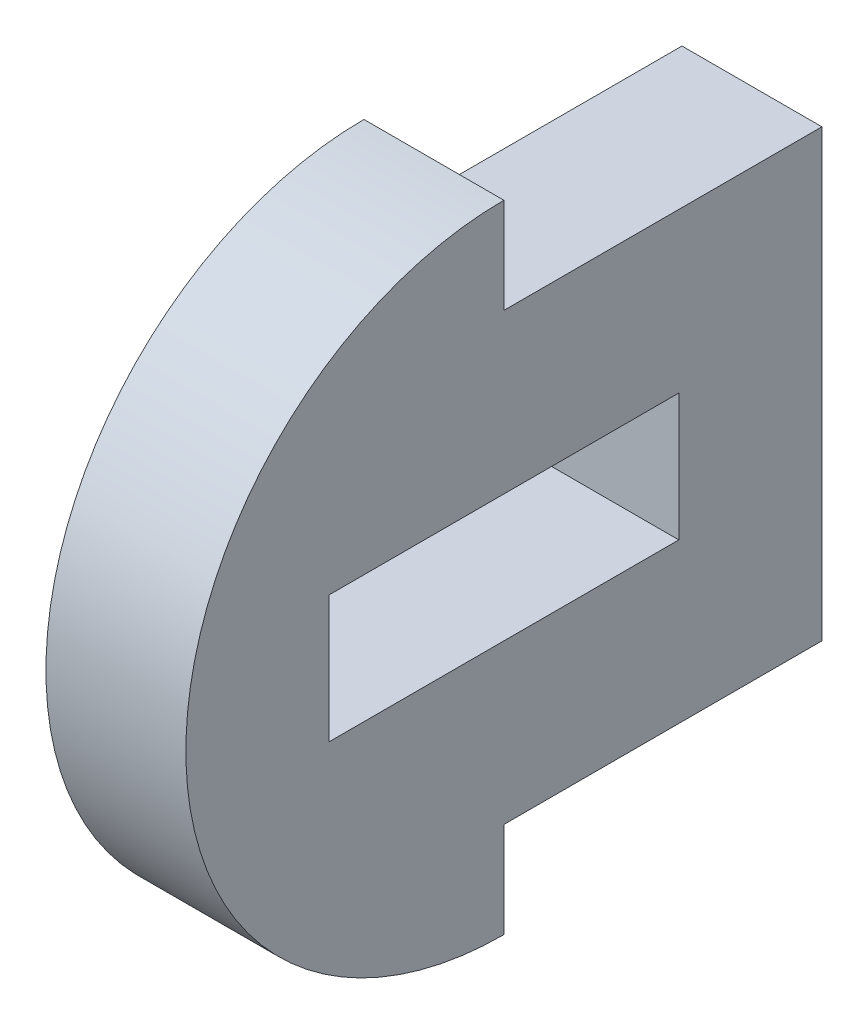
ISO-10303-21;
HEADER;
FILE_DESCRIPTION(('STEP AP214'),'2;1');
FILE_NAME('part.step','',(''),(''),'','','');
FILE_SCHEMA(('AUTOMOTIVE_DESIGN { 1 0 10303 214 1 1 1 1 }'));
ENDSEC;
DATA;
#1=APPLICATION_CONTEXT('core data for automotive mechanical design processes');
#2=APPLICATION_PROTOCOL_DEFINITION('international standard','automotive_design',2000,#1);
#3=PRODUCT_CONTEXT('',#1,'mechanical');
#4=PRODUCT('Part','Part','',(#3));
#5=PRODUCT_RELATED_PRODUCT_CATEGORY('part','',(#4));
#6=PRODUCT_DEFINITION_FORMATION('','',#4);
#7=PRODUCT_DEFINITION_CONTEXT('part definition',#1,'design');
#8=PRODUCT_DEFINITION('design','',#6,#7);
#9=PRODUCT_DEFINITION_SHAPE('','',#8);
#10=(LENGTH_UNIT() NAMED_UNIT(*) SI_UNIT(.MILLI.,.METRE.));
#11=(NAMED_UNIT(*) PLANE_ANGLE_UNIT() SI_UNIT($,.RADIAN.));
#12=(NAMED_UNIT(*) SI_UNIT($,.STERADIAN.) SOLID_ANGLE_UNIT());
#13=UNCERTAINTY_MEASURE_WITH_UNIT(LENGTH_MEASURE(1.E-05),#10,'distance_accuracy_value','');
#14=(GEOMETRIC_REPRESENTATION_CONTEXT(3) GLOBAL_UNCERTAINTY_ASSIGNED_CONTEXT((#13)) GLOBAL_UNIT_ASSIGNED_CONTEXT((#10,
#11,#12)) REPRESENTATION_CONTEXT('',''));
#15=CARTESIAN_POINT('',(0.,0.,0.));
#16=DIRECTION('',(0.,0.,1.));
#17=DIRECTION('',(1.,0.,0.));
#18=AXIS2_PLACEMENT_3D('',#15,#16,#17);
#19=CARTESIAN_POINT('',(4.4,0.,0.));
#20=DIRECTION('',(1.,0.,0.));
#21=DIRECTION('',(0.,0.,-1.));
#22=AXIS2_PLACEMENT_3D('',#19,#20,#21);
#23=PLANE('',#22);
#24=CARTESIAN_POINT('',(4.4,0.,0.));
#25=DIRECTION('',(1.,0.,0.));
#26=DIRECTION('',(0.,0.,-1.));
#27=AXIS2_PLACEMENT_3D('',#24,#25,#26);
#28=CIRCLE('',#27,10.);
#29=CARTESIAN_POINT('',(4.4,10.,0.));
#30=VERTEX_POINT('',#29);
#31=CARTESIAN_POINT('',(4.4,-10.,0.));
#32=VERTEX_POINT('',#31);
#33=EDGE_CURVE('E146',#30,#32,#28,.T.);
#34=ORIENTED_EDGE('',*,*,#33,.T.);
#35=DIRECTION('',(0.,1.,0.));
#36=VECTOR('',#35,1.);
#37=CARTESIAN_POINT('',(4.4,-7.,0.));
#38=LINE('',#37,#36);
#39=CARTESIAN_POINT('',(4.4,-7.,0.));
#40=VERTEX_POINT('',#39);
#41=EDGE_CURVE('E149',#32,#40,#38,.T.);
#42=ORIENTED_EDGE('',*,*,#41,.T.);
#43=DIRECTION('',(0.,0.,-1.));
#44=VECTOR('',#43,1.);
#45=CARTESIAN_POINT('',(4.4,-7.,-10.));
#46=LINE('',#45,#44);
#47=CARTESIAN_POINT('',(4.4,-7.,-10.));
#48=VERTEX_POINT('',#47);
#49=EDGE_CURVE('E152',#40,#48,#46,.T.);
#50=ORIENTED_EDGE('',*,*,#49,.T.);
#51=DIRECTION('',(0.,1.,0.));
#52=VECTOR('',#51,1.);
#53=CARTESIAN_POINT('',(4.4,7.,-10.));
#54=LINE('',#53,#52);
#55=CARTESIAN_POINT('',(4.4,7.,-10.));
#56=VERTEX_POINT('',#55);
#57=EDGE_CURVE('E154',#48,#56,#54,.T.);
#58=ORIENTED_EDGE('',*,*,#57,.T.);
#59=DIRECTION('',(0.,0.,1.));
#60=VECTOR('',#59,1.);
#61=CARTESIAN_POINT('',(4.4,7.,0.));
#62=LINE('',#61,#60);
#63=CARTESIAN_POINT('',(4.4,7.,0.));
#64=VERTEX_POINT('',#63);
#65=EDGE_CURVE('E156',#56,#64,#62,.T.);
#66=ORIENTED_EDGE('',*,*,#65,.T.);
#67=DIRECTION('',(0.,1.,0.));
#68=VECTOR('',#67,1.);
#69=CARTESIAN_POINT('',(4.4,10.,0.));
#70=LINE('',#69,#68);
#71=EDGE_CURVE('E158',#64,#30,#70,.T.);
#72=ORIENTED_EDGE('',*,*,#71,.T.);
#73=EDGE_LOOP('',(#34,#42,#50,#58,#66,#72));
#74=FACE_BOUND('',#73,.T.);
#75=DIRECTION('',(0.,0.,-1.));
#76=VECTOR('',#75,1.);
#77=CARTESIAN_POINT('',(4.4,-2.,5.5));
#78=LINE('',#77,#76);
#79=CARTESIAN_POINT('',(4.4,-2.,5.5));
#80=VERTEX_POINT('',#79);
#81=CARTESIAN_POINT('',(4.4,-2.,-5.5));
#82=VERTEX_POINT('',#81);
#83=EDGE_CURVE('E118',#80,#82,#78,.T.);
#84=ORIENTED_EDGE('',*,*,#83,.F.);
#85=DIRECTION('',(0.,-1.,0.));
#86=VECTOR('',#85,1.);
#87=CARTESIAN_POINT('',(4.4,2.,5.5));
#88=LINE('',#87,#86);
#89=CARTESIAN_POINT('',(4.4,2.,5.5));
#90=VERTEX_POINT('',#89);
#91=EDGE_CURVE('E110',#90,#80,#88,.T.);
#92=ORIENTED_EDGE('',*,*,#91,.F.);
#93=DIRECTION('',(0.,0.,1.));
#94=VECTOR('',#93,1.);
#95=CARTESIAN_POINT('',(4.4,2.,5.5));
#96=LINE('',#95,#94);
#97=CARTESIAN_POINT('',(4.4,2.,-5.5));
#98=VERTEX_POINT('',#97);
#99=EDGE_CURVE('E132',#98,#90,#96,.T.);
#100=ORIENTED_EDGE('',*,*,#99,.F.);
#101=DIRECTION('',(0.,1.,0.));
#102=VECTOR('',#101,1.);
#103=CARTESIAN_POINT('',(4.4,2.,-5.5));
#104=LINE('',#103,#102);
#105=EDGE_CURVE('E130',#82,#98,#104,.T.);
#106=ORIENTED_EDGE('',*,*,#105,.F.);
#107=EDGE_LOOP('',(#84,#92,#100,#106));
#108=FACE_BOUND('',#107,.T.);
#109=ADVANCED_FACE('F33',(#74,#108),#23,.T.);
#110=CARTESIAN_POINT('',(0.,0.,0.));
#111=DIRECTION('',(1.,0.,0.));
#112=DIRECTION('',(0.,0.,-1.));
#113=AXIS2_PLACEMENT_3D('',#110,#111,#112);
#114=PLANE('',#113);
#115=CARTESIAN_POINT('',(0.,0.,0.));
#116=DIRECTION('',(1.,0.,0.));
#117=DIRECTION('',(0.,0.,-1.));
#118=AXIS2_PLACEMENT_3D('',#115,#116,#117);
#119=CIRCLE('',#118,10.);
#120=CARTESIAN_POINT('',(0.,10.,0.));
#121=VERTEX_POINT('',#120);
#122=CARTESIAN_POINT('',(0.,-10.,0.));
#123=VERTEX_POINT('',#122);
#124=EDGE_CURVE('E126',#121,#123,#119,.T.);
#125=ORIENTED_EDGE('',*,*,#124,.F.);
#126=DIRECTION('',(0.,1.,0.));
#127=VECTOR('',#126,1.);
#128=CARTESIAN_POINT('',(0.,10.,0.));
#129=LINE('',#128,#127);
#130=CARTESIAN_POINT('',(0.,7.,0.));
#131=VERTEX_POINT('',#130);
#132=EDGE_CURVE('E150',#131,#121,#129,.T.);
#133=ORIENTED_EDGE('',*,*,#132,.F.);
#134=DIRECTION('',(0.,0.,1.));
#135=VECTOR('',#134,1.);
#136=CARTESIAN_POINT('',(0.,7.,0.));
#137=LINE('',#136,#135);
#138=CARTESIAN_POINT('',(0.,7.,-10.));
#139=VERTEX_POINT('',#138);
#140=EDGE_CURVE('E169',#139,#131,#137,.T.);
#141=ORIENTED_EDGE('',*,*,#140,.F.);
#142=DIRECTION('',(0.,1.,0.));
#143=VECTOR('',#142,1.);
#144=CARTESIAN_POINT('',(0.,7.,-10.));
#145=LINE('',#144,#143);
#146=CARTESIAN_POINT('',(0.,-7.,-10.));
#147=VERTEX_POINT('',#146);
#148=EDGE_CURVE('E167',#147,#139,#145,.T.);
#149=ORIENTED_EDGE('',*,*,#148,.F.);
#150=DIRECTION('',(0.,0.,-1.));
#151=VECTOR('',#150,1.);
#152=CARTESIAN_POINT('',(0.,-7.,-10.));
#153=LINE('',#152,#151);
#154=CARTESIAN_POINT('',(0.,-7.,0.));
#155=VERTEX_POINT('',#154);
#156=EDGE_CURVE('E165',#155,#147,#153,.T.);
#157=ORIENTED_EDGE('',*,*,#156,.F.);
#158=DIRECTION('',(0.,1.,0.));
#159=VECTOR('',#158,1.);
#160=CARTESIAN_POINT('',(0.,-7.,0.));
#161=LINE('',#160,#159);
#162=EDGE_CURVE('E163',#123,#155,#161,.T.);
#163=ORIENTED_EDGE('',*,*,#162,.F.);
#164=EDGE_LOOP('',(#125,#133,#141,#149,#157,#163));
#165=FACE_BOUND('',#164,.T.);
#166=DIRECTION('',(0.,-1.,0.));
#167=VECTOR('',#166,1.);
#168=CARTESIAN_POINT('',(0.,2.,5.5));
#169=LINE('',#168,#167);
#170=CARTESIAN_POINT('',(0.,2.,5.5));
#171=VERTEX_POINT('',#170);
#172=CARTESIAN_POINT('',(0.,-2.,5.5));
#173=VERTEX_POINT('',#172);
#174=EDGE_CURVE('E56',#171,#173,#169,.T.);
#175=ORIENTED_EDGE('',*,*,#174,.T.);
#176=DIRECTION('',(0.,0.,-1.));
#177=VECTOR('',#176,1.);
#178=CARTESIAN_POINT('',(0.,-2.,5.5));
#179=LINE('',#178,#177);
#180=CARTESIAN_POINT('',(0.,-2.,-5.5));
#181=VERTEX_POINT('',#180);
#182=EDGE_CURVE('E125',#173,#181,#179,.T.);
#183=ORIENTED_EDGE('',*,*,#182,.T.);
#184=DIRECTION('',(0.,1.,0.));
#185=VECTOR('',#184,1.);
#186=CARTESIAN_POINT('',(0.,2.,-5.5));
#187=LINE('',#186,#185);
#188=CARTESIAN_POINT('',(0.,2.,-5.5));
#189=VERTEX_POINT('',#188);
#190=EDGE_CURVE('E138',#181,#189,#187,.T.);
#191=ORIENTED_EDGE('',*,*,#190,.T.);
#192=DIRECTION('',(0.,0.,1.));
#193=VECTOR('',#192,1.);
#194=CARTESIAN_POINT('',(0.,2.,5.5));
#195=LINE('',#194,#193);
#196=EDGE_CURVE('E119',#189,#171,#195,.T.);
#197=ORIENTED_EDGE('',*,*,#196,.T.);
#198=EDGE_LOOP('',(#175,#183,#191,#197));
#199=FACE_BOUND('',#198,.T.);
#200=ADVANCED_FACE('F193',(#165,#199),#114,.F.);
#201=CARTESIAN_POINT('',(4.4,0.,0.));
#202=DIRECTION('',(-1.,0.,0.));
#203=DIRECTION('',(0.,0.,1.));
#204=AXIS2_PLACEMENT_3D('',#201,#202,#203);
#205=CYLINDRICAL_SURFACE('',#204,10.);
#206=ORIENTED_EDGE('',*,*,#124,.T.);
#207=DIRECTION('',(-1.,0.,0.));
#208=VECTOR('',#207,1.);
#209=CARTESIAN_POINT('',(4.4,-10.,0.));
#210=LINE('',#209,#208);
#211=EDGE_CURVE('E11',#32,#123,#210,.T.);
#212=ORIENTED_EDGE('',*,*,#211,.F.);
#213=ORIENTED_EDGE('',*,*,#33,.F.);
#214=DIRECTION('',(-1.,0.,0.));
#215=VECTOR('',#214,1.);
#216=CARTESIAN_POINT('',(4.4,10.,0.));
#217=LINE('',#216,#215);
#218=EDGE_CURVE('E160',#30,#121,#217,.T.);
#219=ORIENTED_EDGE('',*,*,#218,.T.);
#220=EDGE_LOOP('',(#206,#212,#213,#219));
#221=FACE_BOUND('',#220,.T.);
#222=ADVANCED_FACE('F35',(#221),#205,.T.);
#223=CARTESIAN_POINT('',(4.4,-7.,0.));
#224=DIRECTION('',(0.,0.,1.));
#225=DIRECTION('',(0.,-1.,0.));
#226=AXIS2_PLACEMENT_3D('',#223,#224,#225);
#227=PLANE('',#226);
#228=ORIENTED_EDGE('',*,*,#162,.T.);
#229=DIRECTION('',(-1.,0.,0.));
#230=VECTOR('',#229,1.);
#231=CARTESIAN_POINT('',(4.4,-7.,0.));
#232=LINE('',#231,#230);
#233=EDGE_CURVE('E41',#40,#155,#232,.T.);
#234=ORIENTED_EDGE('',*,*,#233,.F.);
#235=ORIENTED_EDGE('',*,*,#41,.F.);
#236=ORIENTED_EDGE('',*,*,#211,.T.);
#237=EDGE_LOOP('',(#228,#234,#235,#236));
#238=FACE_BOUND('',#237,.T.);
#239=ADVANCED_FACE('F210',(#238),#227,.F.);
#240=CARTESIAN_POINT('',(4.4,-7.,-10.));
#241=DIRECTION('',(0.,1.,0.));
#242=DIRECTION('',(0.,0.,1.));
#243=AXIS2_PLACEMENT_3D('',#240,#241,#242);
#244=PLANE('',#243);
#245=ORIENTED_EDGE('',*,*,#156,.T.);
#246=DIRECTION('',(-1.,0.,0.));
#247=VECTOR('',#246,1.);
#248=CARTESIAN_POINT('',(4.4,-7.,-10.));
#249=LINE('',#248,#247);
#250=EDGE_CURVE('E180',#48,#147,#249,.T.);
#251=ORIENTED_EDGE('',*,*,#250,.F.);
#252=ORIENTED_EDGE('',*,*,#49,.F.);
#253=ORIENTED_EDGE('',*,*,#233,.T.);
#254=EDGE_LOOP('',(#245,#251,#252,#253));
#255=FACE_BOUND('',#254,.T.);
#256=ADVANCED_FACE('F187',(#255),#244,.F.);
#257=CARTESIAN_POINT('',(4.4,7.,-10.));
#258=DIRECTION('',(0.,0.,1.));
#259=DIRECTION('',(0.,-1.,0.));
#260=AXIS2_PLACEMENT_3D('',#257,#258,#259);
#261=PLANE('',#260);
#262=ORIENTED_EDGE('',*,*,#148,.T.);
#263=DIRECTION('',(-1.,0.,0.));
#264=VECTOR('',#263,1.);
#265=CARTESIAN_POINT('',(4.4,7.,-10.));
#266=LINE('',#265,#264);
#267=EDGE_CURVE('E177',#56,#139,#266,.T.);
#268=ORIENTED_EDGE('',*,*,#267,.F.);
#269=ORIENTED_EDGE('',*,*,#57,.F.);
#270=ORIENTED_EDGE('',*,*,#250,.T.);
#271=EDGE_LOOP('',(#262,#268,#269,#270));
#272=FACE_BOUND('',#271,.T.);
#273=ADVANCED_FACE('F199',(#272),#261,.F.);
#274=CARTESIAN_POINT('',(4.4,7.,0.));
#275=DIRECTION('',(0.,-1.,0.));
#276=DIRECTION('',(0.,0.,-1.));
#277=AXIS2_PLACEMENT_3D('',#274,#275,#276);
#278=PLANE('',#277);
#279=ORIENTED_EDGE('',*,*,#140,.T.);
#280=DIRECTION('',(-1.,0.,0.));
#281=VECTOR('',#280,1.);
#282=CARTESIAN_POINT('',(4.4,7.,0.));
#283=LINE('',#282,#281);
#284=EDGE_CURVE('E174',#64,#131,#283,.T.);
#285=ORIENTED_EDGE('',*,*,#284,.F.);
#286=ORIENTED_EDGE('',*,*,#65,.F.);
#287=ORIENTED_EDGE('',*,*,#267,.T.);
#288=EDGE_LOOP('',(#279,#285,#286,#287));
#289=FACE_BOUND('',#288,.T.);
#290=ADVANCED_FACE('F203',(#289),#278,.F.);
#291=CARTESIAN_POINT('',(4.4,10.,0.));
#292=DIRECTION('',(0.,0.,1.));
#293=DIRECTION('',(0.,-1.,0.));
#294=AXIS2_PLACEMENT_3D('',#291,#292,#293);
#295=PLANE('',#294);
#296=ORIENTED_EDGE('',*,*,#132,.T.);
#297=ORIENTED_EDGE('',*,*,#218,.F.);
#298=ORIENTED_EDGE('',*,*,#71,.F.);
#299=ORIENTED_EDGE('',*,*,#284,.T.);
#300=EDGE_LOOP('',(#296,#297,#298,#299));
#301=FACE_BOUND('',#300,.T.);
#302=ADVANCED_FACE('F213',(#301),#295,.F.);
#303=CARTESIAN_POINT('',(4.4,2.,5.5));
#304=DIRECTION('',(0.,0.,-1.));
#305=DIRECTION('',(0.,1.,0.));
#306=AXIS2_PLACEMENT_3D('',#303,#304,#305);
#307=PLANE('',#306);
#308=ORIENTED_EDGE('',*,*,#174,.F.);
#309=DIRECTION('',(-1.,0.,0.));
#310=VECTOR('',#309,1.);
#311=CARTESIAN_POINT('',(4.4,2.,5.5));
#312=LINE('',#311,#310);
#313=EDGE_CURVE('E114',#90,#171,#312,.T.);
#314=ORIENTED_EDGE('',*,*,#313,.F.);
#315=ORIENTED_EDGE('',*,*,#91,.T.);
#316=DIRECTION('',(-1.,0.,0.));
#317=VECTOR('',#316,1.);
#318=CARTESIAN_POINT('',(4.4,-2.,5.5));
#319=LINE('',#318,#317);
#320=EDGE_CURVE('E113',#80,#173,#319,.T.);
#321=ORIENTED_EDGE('',*,*,#320,.T.);
#322=EDGE_LOOP('',(#308,#314,#315,#321));
#323=FACE_BOUND('',#322,.T.);
#324=ADVANCED_FACE('F112',(#323),#307,.T.);
#325=CARTESIAN_POINT('',(4.4,-2.,5.5));
#326=DIRECTION('',(0.,1.,0.));
#327=DIRECTION('',(0.,0.,1.));
#328=AXIS2_PLACEMENT_3D('',#325,#326,#327);
#329=PLANE('',#328);
#330=ORIENTED_EDGE('',*,*,#182,.F.);
#331=ORIENTED_EDGE('',*,*,#320,.F.);
#332=ORIENTED_EDGE('',*,*,#83,.T.);
#333=DIRECTION('',(-1.,0.,0.));
#334=VECTOR('',#333,1.);
#335=CARTESIAN_POINT('',(4.4,-2.,-5.5));
#336=LINE('',#335,#334);
#337=EDGE_CURVE('E127',#82,#181,#336,.T.);
#338=ORIENTED_EDGE('',*,*,#337,.T.);
#339=EDGE_LOOP('',(#330,#331,#332,#338));
#340=FACE_BOUND('',#339,.T.);
#341=ADVANCED_FACE('F122',(#340),#329,.T.);
#342=CARTESIAN_POINT('',(4.4,2.,-5.5));
#343=DIRECTION('',(0.,0.,1.));
#344=DIRECTION('',(0.,-1.,0.));
#345=AXIS2_PLACEMENT_3D('',#342,#343,#344);
#346=PLANE('',#345);
#347=ORIENTED_EDGE('',*,*,#190,.F.);
#348=ORIENTED_EDGE('',*,*,#337,.F.);
#349=ORIENTED_EDGE('',*,*,#105,.T.);
#350=DIRECTION('',(-1.,0.,0.));
#351=VECTOR('',#350,1.);
#352=CARTESIAN_POINT('',(4.4,2.,-5.5));
#353=LINE('',#352,#351);
#354=EDGE_CURVE('E48',#98,#189,#353,.T.);
#355=ORIENTED_EDGE('',*,*,#354,.T.);
#356=EDGE_LOOP('',(#347,#348,#349,#355));
#357=FACE_BOUND('',#356,.T.);
#358=ADVANCED_FACE('F231',(#357),#346,.T.);
#359=CARTESIAN_POINT('',(4.4,2.,5.5));
#360=DIRECTION('',(0.,-1.,0.));
#361=DIRECTION('',(0.,0.,-1.));
#362=AXIS2_PLACEMENT_3D('',#359,#360,#361);
#363=PLANE('',#362);
#364=ORIENTED_EDGE('',*,*,#196,.F.);
#365=ORIENTED_EDGE('',*,*,#354,.F.);
#366=ORIENTED_EDGE('',*,*,#99,.T.);
#367=ORIENTED_EDGE('',*,*,#313,.T.);
#368=EDGE_LOOP('',(#364,#365,#366,#367));
#369=FACE_BOUND('',#368,.T.);
#370=ADVANCED_FACE('F234',(#369),#363,.T.);
#371=CLOSED_SHELL('',(#109,#200,#222,#239,#256,#273,#290,#302,#324,#341,#358,#370));
#372=MANIFOLD_SOLID_BREP('B2',#371);
#373=ADVANCED_BREP_SHAPE_REPRESENTATION('',(#18,#372),#14);
#374=SHAPE_DEFINITION_REPRESENTATION(#9,#373);
ENDSEC;
END-ISO-10303-21;
